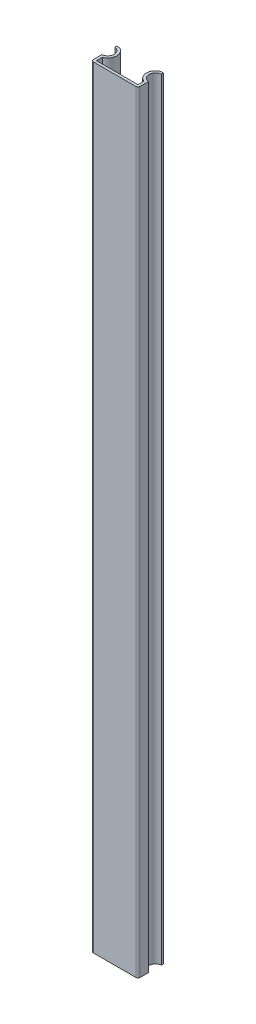
ISO-10303-21;
HEADER;
FILE_DESCRIPTION(('STEP AP214'),'2;1');
FILE_NAME('part.step','',(''),(''),'','','');
FILE_SCHEMA(('AUTOMOTIVE_DESIGN { 1 0 10303 214 1 1 1 1 }'));
ENDSEC;
DATA;
#1=APPLICATION_CONTEXT('core data for automotive mechanical design processes');
#2=APPLICATION_PROTOCOL_DEFINITION('international standard','automotive_design',2000,#1);
#3=PRODUCT_CONTEXT('',#1,'mechanical');
#4=PRODUCT('Part','Part','',(#3));
#5=PRODUCT_RELATED_PRODUCT_CATEGORY('part','',(#4));
#6=PRODUCT_DEFINITION_FORMATION('','',#4);
#7=PRODUCT_DEFINITION_CONTEXT('part definition',#1,'design');
#8=PRODUCT_DEFINITION('design','',#6,#7);
#9=PRODUCT_DEFINITION_SHAPE('','',#8);
#10=(LENGTH_UNIT() NAMED_UNIT(*) SI_UNIT(.MILLI.,.METRE.));
#11=(NAMED_UNIT(*) PLANE_ANGLE_UNIT() SI_UNIT($,.RADIAN.));
#12=(NAMED_UNIT(*) SI_UNIT($,.STERADIAN.) SOLID_ANGLE_UNIT());
#13=UNCERTAINTY_MEASURE_WITH_UNIT(LENGTH_MEASURE(1.E-05),#10,'distance_accuracy_value','');
#14=(GEOMETRIC_REPRESENTATION_CONTEXT(3) GLOBAL_UNCERTAINTY_ASSIGNED_CONTEXT((#13)) GLOBAL_UNIT_ASSIGNED_CONTEXT((#10,
#11,#12)) REPRESENTATION_CONTEXT('',''));
#15=CARTESIAN_POINT('',(0.,0.,0.));
#16=DIRECTION('',(0.,0.,1.));
#17=DIRECTION('',(1.,0.,0.));
#18=AXIS2_PLACEMENT_3D('',#15,#16,#17);
#19=CARTESIAN_POINT('',(-5.5,182.,0.));
#20=DIRECTION('',(1.,0.,0.));
#21=DIRECTION('',(0.,0.,-1.));
#22=AXIS2_PLACEMENT_3D('',#19,#20,#21);
#23=PLANE('',#22);
#24=DIRECTION('',(0.,0.,1.));
#25=VECTOR('',#24,1.);
#26=CARTESIAN_POINT('',(-5.5,0.,0.));
#27=LINE('',#26,#25);
#28=CARTESIAN_POINT('',(-5.5,0.,-2.47684537882722));
#29=VERTEX_POINT('',#28);
#30=CARTESIAN_POINT('',(-5.5,0.,-0.499999999999999));
#31=VERTEX_POINT('',#30);
#32=EDGE_CURVE('E191',#29,#31,#27,.T.);
#33=ORIENTED_EDGE('',*,*,#32,.T.);
#34=DIRECTION('',(0.,-1.,0.));
#35=VECTOR('',#34,1.);
#36=CARTESIAN_POINT('',(-5.5,182.,-0.499999999999999));
#37=LINE('',#36,#35);
#38=CARTESIAN_POINT('',(-5.5,182.,-0.499999999999999));
#39=VERTEX_POINT('',#38);
#40=EDGE_CURVE('E54',#31,#39,#37,.F.);
#41=ORIENTED_EDGE('',*,*,#40,.T.);
#42=DIRECTION('',(0.,0.,1.));
#43=VECTOR('',#42,1.);
#44=CARTESIAN_POINT('',(-5.5,182.,0.));
#45=LINE('',#44,#43);
#46=CARTESIAN_POINT('',(-5.5,182.,-2.47684537882722));
#47=VERTEX_POINT('',#46);
#48=EDGE_CURVE('E219',#47,#39,#45,.T.);
#49=ORIENTED_EDGE('',*,*,#48,.F.);
#50=DIRECTION('',(0.,-1.,0.));
#51=VECTOR('',#50,1.);
#52=CARTESIAN_POINT('',(-5.5,182.,-2.47684537882722));
#53=LINE('',#52,#51);
#54=EDGE_CURVE('E190',#47,#29,#53,.T.);
#55=ORIENTED_EDGE('',*,*,#54,.T.);
#56=EDGE_LOOP('',(#33,#41,#49,#55));
#57=FACE_BOUND('',#56,.T.);
#58=ADVANCED_FACE('F31',(#57),#23,.F.);
#59=CARTESIAN_POINT('',(5.5,182.,0.));
#60=DIRECTION('',(0.,0.,-1.));
#61=DIRECTION('',(-1.,0.,0.));
#62=AXIS2_PLACEMENT_3D('',#59,#60,#61);
#63=PLANE('',#62);
#64=DIRECTION('',(1.,0.,0.));
#65=VECTOR('',#64,1.);
#66=CARTESIAN_POINT('',(5.5,182.,0.));
#67=LINE('',#66,#65);
#68=CARTESIAN_POINT('',(-5.,182.,0.));
#69=VERTEX_POINT('',#68);
#70=CARTESIAN_POINT('',(5.,182.,0.));
#71=VERTEX_POINT('',#70);
#72=EDGE_CURVE('E152',#69,#71,#67,.T.);
#73=ORIENTED_EDGE('',*,*,#72,.F.);
#74=DIRECTION('',(0.,-1.,0.));
#75=VECTOR('',#74,1.);
#76=CARTESIAN_POINT('',(-5.,182.,0.));
#77=LINE('',#76,#75);
#78=CARTESIAN_POINT('',(-5.,0.,0.));
#79=VERTEX_POINT('',#78);
#80=EDGE_CURVE('E251',#69,#79,#77,.T.);
#81=ORIENTED_EDGE('',*,*,#80,.T.);
#82=DIRECTION('',(1.,0.,0.));
#83=VECTOR('',#82,1.);
#84=CARTESIAN_POINT('',(5.5,0.,0.));
#85=LINE('',#84,#83);
#86=CARTESIAN_POINT('',(5.,0.,0.));
#87=VERTEX_POINT('',#86);
#88=EDGE_CURVE('E193',#79,#87,#85,.T.);
#89=ORIENTED_EDGE('',*,*,#88,.T.);
#90=DIRECTION('',(0.,-1.,0.));
#91=VECTOR('',#90,1.);
#92=CARTESIAN_POINT('',(5.,182.,0.));
#93=LINE('',#92,#91);
#94=EDGE_CURVE('E161',#87,#71,#93,.F.);
#95=ORIENTED_EDGE('',*,*,#94,.T.);
#96=EDGE_LOOP('',(#73,#81,#89,#95));
#97=FACE_BOUND('',#96,.T.);
#98=ADVANCED_FACE('F264',(#97),#63,.F.);
#99=CARTESIAN_POINT('',(5.5,182.,0.));
#100=DIRECTION('',(-1.,0.,0.));
#101=DIRECTION('',(0.,0.,1.));
#102=AXIS2_PLACEMENT_3D('',#99,#100,#101);
#103=PLANE('',#102);
#104=DIRECTION('',(0.,0.,-1.));
#105=VECTOR('',#104,1.);
#106=CARTESIAN_POINT('',(5.5,182.,0.));
#107=LINE('',#106,#105);
#108=CARTESIAN_POINT('',(5.5,182.,-0.499999999999999));
#109=VERTEX_POINT('',#108);
#110=CARTESIAN_POINT('',(5.5,182.,-2.47684537882722));
#111=VERTEX_POINT('',#110);
#112=EDGE_CURVE('E144',#109,#111,#107,.T.);
#113=ORIENTED_EDGE('',*,*,#112,.F.);
#114=DIRECTION('',(0.,-1.,0.));
#115=VECTOR('',#114,1.);
#116=CARTESIAN_POINT('',(5.5,182.,-0.499999999999999));
#117=LINE('',#116,#115);
#118=CARTESIAN_POINT('',(5.5,0.,-0.499999999999999));
#119=VERTEX_POINT('',#118);
#120=EDGE_CURVE('E11',#109,#119,#117,.T.);
#121=ORIENTED_EDGE('',*,*,#120,.T.);
#122=DIRECTION('',(0.,0.,-1.));
#123=VECTOR('',#122,1.);
#124=CARTESIAN_POINT('',(5.5,0.,0.));
#125=LINE('',#124,#123);
#126=CARTESIAN_POINT('',(5.5,0.,-2.47684537882722));
#127=VERTEX_POINT('',#126);
#128=EDGE_CURVE('E158',#119,#127,#125,.T.);
#129=ORIENTED_EDGE('',*,*,#128,.T.);
#130=DIRECTION('',(0.,-1.,0.));
#131=VECTOR('',#130,1.);
#132=CARTESIAN_POINT('',(5.5,182.,-2.47684537882722));
#133=LINE('',#132,#131);
#134=EDGE_CURVE('E155',#111,#127,#133,.T.);
#135=ORIENTED_EDGE('',*,*,#134,.F.);
#136=EDGE_LOOP('',(#113,#121,#129,#135));
#137=FACE_BOUND('',#136,.T.);
#138=ADVANCED_FACE('F156',(#137),#103,.F.);
#139=CARTESIAN_POINT('',(5.62857142857143,182.,-4.));
#140=DIRECTION('',(0.,-1.,0.));
#141=DIRECTION('',(0.,0.,-1.));
#142=AXIS2_PLACEMENT_3D('',#139,#140,#141);
#143=CYLINDRICAL_SURFACE('',#142,1.52857142857143);
#144=CARTESIAN_POINT('',(5.62857142857143,0.,-4.));
#145=DIRECTION('',(0.,-1.,0.));
#146=DIRECTION('',(0.,0.,-1.));
#147=AXIS2_PLACEMENT_3D('',#144,#145,#146);
#148=CIRCLE('',#147,1.52857142857143);
#149=CARTESIAN_POINT('',(5.5,0.,-5.52315462117278));
#150=VERTEX_POINT('',#149);
#151=EDGE_CURVE('E197',#127,#150,#148,.T.);
#152=ORIENTED_EDGE('',*,*,#151,.T.);
#153=DIRECTION('',(0.,-1.,0.));
#154=VECTOR('',#153,1.);
#155=CARTESIAN_POINT('',(5.5,182.,-5.52315462117278));
#156=LINE('',#155,#154);
#157=CARTESIAN_POINT('',(5.5,182.,-5.52315462117278));
#158=VERTEX_POINT('',#157);
#159=EDGE_CURVE('E162',#158,#150,#156,.T.);
#160=ORIENTED_EDGE('',*,*,#159,.F.);
#161=CARTESIAN_POINT('',(5.62857142857143,182.,-4.));
#162=DIRECTION('',(0.,-1.,0.));
#163=DIRECTION('',(0.,0.,-1.));
#164=AXIS2_PLACEMENT_3D('',#161,#162,#163);
#165=CIRCLE('',#164,1.52857142857143);
#166=EDGE_CURVE('E148',#111,#158,#165,.T.);
#167=ORIENTED_EDGE('',*,*,#166,.F.);
#168=ORIENTED_EDGE('',*,*,#134,.T.);
#169=EDGE_LOOP('',(#152,#160,#167,#168));
#170=FACE_BOUND('',#169,.T.);
#171=ADVANCED_FACE('F164',(#170),#143,.F.);
#172=CARTESIAN_POINT('',(5.5,182.,-6.));
#173=DIRECTION('',(-1.,0.,0.));
#174=DIRECTION('',(0.,0.,1.));
#175=AXIS2_PLACEMENT_3D('',#172,#173,#174);
#176=PLANE('',#175);
#177=DIRECTION('',(0.,0.,-1.));
#178=VECTOR('',#177,1.);
#179=CARTESIAN_POINT('',(5.5,0.,-6.));
#180=LINE('',#179,#178);
#181=CARTESIAN_POINT('',(5.5,0.,-6.));
#182=VERTEX_POINT('',#181);
#183=EDGE_CURVE('E199',#150,#182,#180,.T.);
#184=ORIENTED_EDGE('',*,*,#183,.T.);
#185=DIRECTION('',(0.,-1.,0.));
#186=VECTOR('',#185,1.);
#187=CARTESIAN_POINT('',(5.5,182.,-6.));
#188=LINE('',#187,#186);
#189=CARTESIAN_POINT('',(5.5,182.,-6.));
#190=VERTEX_POINT('',#189);
#191=EDGE_CURVE('E246',#190,#182,#188,.T.);
#192=ORIENTED_EDGE('',*,*,#191,.F.);
#193=DIRECTION('',(0.,0.,-1.));
#194=VECTOR('',#193,1.);
#195=CARTESIAN_POINT('',(5.5,182.,-6.));
#196=LINE('',#195,#194);
#197=EDGE_CURVE('E167',#158,#190,#196,.T.);
#198=ORIENTED_EDGE('',*,*,#197,.F.);
#199=ORIENTED_EDGE('',*,*,#159,.T.);
#200=EDGE_LOOP('',(#184,#192,#198,#199));
#201=FACE_BOUND('',#200,.T.);
#202=ADVANCED_FACE('F319',(#201),#176,.F.);
#203=CARTESIAN_POINT('',(5.5,182.,-6.));
#204=DIRECTION('',(0.,0.,1.));
#205=DIRECTION('',(1.,0.,0.));
#206=AXIS2_PLACEMENT_3D('',#203,#204,#205);
#207=PLANE('',#206);
#208=DIRECTION('',(-1.,0.,0.));
#209=VECTOR('',#208,1.);
#210=CARTESIAN_POINT('',(5.5,0.,-6.));
#211=LINE('',#210,#209);
#212=CARTESIAN_POINT('',(4.9,0.,-6.));
#213=VERTEX_POINT('',#212);
#214=EDGE_CURVE('E201',#182,#213,#211,.T.);
#215=ORIENTED_EDGE('',*,*,#214,.T.);
#216=DIRECTION('',(0.,-1.,0.));
#217=VECTOR('',#216,1.);
#218=CARTESIAN_POINT('',(4.9,182.,-6.));
#219=LINE('',#218,#217);
#220=CARTESIAN_POINT('',(4.9,182.,-6.));
#221=VERTEX_POINT('',#220);
#222=EDGE_CURVE('E243',#221,#213,#219,.T.);
#223=ORIENTED_EDGE('',*,*,#222,.F.);
#224=DIRECTION('',(-1.,0.,0.));
#225=VECTOR('',#224,1.);
#226=CARTESIAN_POINT('',(5.5,182.,-6.));
#227=LINE('',#226,#225);
#228=EDGE_CURVE('E169',#190,#221,#227,.T.);
#229=ORIENTED_EDGE('',*,*,#228,.F.);
#230=ORIENTED_EDGE('',*,*,#191,.T.);
#231=EDGE_LOOP('',(#215,#223,#229,#230));
#232=FACE_BOUND('',#231,.T.);
#233=ADVANCED_FACE('F316',(#232),#207,.F.);
#234=CARTESIAN_POINT('',(5.62857142857143,182.,-4.));
#235=DIRECTION('',(0.,-1.,0.));
#236=DIRECTION('',(0.,0.,-1.));
#237=AXIS2_PLACEMENT_3D('',#234,#235,#236);
#238=CYLINDRICAL_SURFACE('',#237,2.12857142857143);
#239=CARTESIAN_POINT('',(5.62857142857143,0.,-4.));
#240=DIRECTION('',(0.,1.,0.));
#241=DIRECTION('',(0.,0.,-1.));
#242=AXIS2_PLACEMENT_3D('',#239,#240,#241);
#243=CIRCLE('',#242,2.12857142857143);
#244=CARTESIAN_POINT('',(4.9,0.,-2.));
#245=VERTEX_POINT('',#244);
#246=EDGE_CURVE('E203',#213,#245,#243,.T.);
#247=ORIENTED_EDGE('',*,*,#246,.T.);
#248=DIRECTION('',(0.,-1.,0.));
#249=VECTOR('',#248,1.);
#250=CARTESIAN_POINT('',(4.9,182.,-2.));
#251=LINE('',#250,#249);
#252=CARTESIAN_POINT('',(4.9,182.,-2.));
#253=VERTEX_POINT('',#252);
#254=EDGE_CURVE('E240',#253,#245,#251,.T.);
#255=ORIENTED_EDGE('',*,*,#254,.F.);
#256=CARTESIAN_POINT('',(5.62857142857143,182.,-4.));
#257=DIRECTION('',(0.,1.,0.));
#258=DIRECTION('',(0.,0.,-1.));
#259=AXIS2_PLACEMENT_3D('',#256,#257,#258);
#260=CIRCLE('',#259,2.12857142857143);
#261=EDGE_CURVE('E174',#221,#253,#260,.T.);
#262=ORIENTED_EDGE('',*,*,#261,.F.);
#263=ORIENTED_EDGE('',*,*,#222,.T.);
#264=EDGE_LOOP('',(#247,#255,#262,#263));
#265=FACE_BOUND('',#264,.T.);
#266=ADVANCED_FACE('F311',(#265),#238,.T.);
#267=CARTESIAN_POINT('',(4.9,182.,-0.599999999999999));
#268=DIRECTION('',(1.,0.,0.));
#269=DIRECTION('',(0.,0.,-1.));
#270=AXIS2_PLACEMENT_3D('',#267,#268,#269);
#271=PLANE('',#270);
#272=DIRECTION('',(0.,0.,1.));
#273=VECTOR('',#272,1.);
#274=CARTESIAN_POINT('',(4.9,0.,-0.599999999999999));
#275=LINE('',#274,#273);
#276=CARTESIAN_POINT('',(4.9,0.,-0.599999999999999));
#277=VERTEX_POINT('',#276);
#278=EDGE_CURVE('E205',#245,#277,#275,.T.);
#279=ORIENTED_EDGE('',*,*,#278,.T.);
#280=DIRECTION('',(0.,-1.,0.));
#281=VECTOR('',#280,1.);
#282=CARTESIAN_POINT('',(4.9,182.,-0.599999999999999));
#283=LINE('',#282,#281);
#284=CARTESIAN_POINT('',(4.9,182.,-0.599999999999999));
#285=VERTEX_POINT('',#284);
#286=EDGE_CURVE('E237',#285,#277,#283,.T.);
#287=ORIENTED_EDGE('',*,*,#286,.F.);
#288=DIRECTION('',(0.,0.,1.));
#289=VECTOR('',#288,1.);
#290=CARTESIAN_POINT('',(4.9,182.,-0.599999999999999));
#291=LINE('',#290,#289);
#292=EDGE_CURVE('E176',#253,#285,#291,.T.);
#293=ORIENTED_EDGE('',*,*,#292,.F.);
#294=ORIENTED_EDGE('',*,*,#254,.T.);
#295=EDGE_LOOP('',(#279,#287,#293,#294));
#296=FACE_BOUND('',#295,.T.);
#297=ADVANCED_FACE('F305',(#296),#271,.F.);
#298=CARTESIAN_POINT('',(4.9,182.,-0.599999999999999));
#299=DIRECTION('',(0.,0.,1.));
#300=DIRECTION('',(1.,0.,0.));
#301=AXIS2_PLACEMENT_3D('',#298,#299,#300);
#302=PLANE('',#301);
#303=DIRECTION('',(-1.,0.,0.));
#304=VECTOR('',#303,1.);
#305=CARTESIAN_POINT('',(4.9,0.,-0.599999999999999));
#306=LINE('',#305,#304);
#307=CARTESIAN_POINT('',(-4.9,0.,-0.599999999999999));
#308=VERTEX_POINT('',#307);
#309=EDGE_CURVE('E207',#277,#308,#306,.T.);
#310=ORIENTED_EDGE('',*,*,#309,.T.);
#311=DIRECTION('',(0.,-1.,0.));
#312=VECTOR('',#311,1.);
#313=CARTESIAN_POINT('',(-4.9,182.,-0.599999999999999));
#314=LINE('',#313,#312);
#315=CARTESIAN_POINT('',(-4.9,182.,-0.599999999999999));
#316=VERTEX_POINT('',#315);
#317=EDGE_CURVE('E234',#316,#308,#314,.T.);
#318=ORIENTED_EDGE('',*,*,#317,.F.);
#319=DIRECTION('',(-1.,0.,0.));
#320=VECTOR('',#319,1.);
#321=CARTESIAN_POINT('',(4.9,182.,-0.599999999999999));
#322=LINE('',#321,#320);
#323=EDGE_CURVE('E178',#285,#316,#322,.T.);
#324=ORIENTED_EDGE('',*,*,#323,.F.);
#325=ORIENTED_EDGE('',*,*,#286,.T.);
#326=EDGE_LOOP('',(#310,#318,#324,#325));
#327=FACE_BOUND('',#326,.T.);
#328=ADVANCED_FACE('F301',(#327),#302,.F.);
#329=CARTESIAN_POINT('',(-4.9,182.,-0.599999999999999));
#330=DIRECTION('',(-1.,0.,0.));
#331=DIRECTION('',(0.,0.,1.));
#332=AXIS2_PLACEMENT_3D('',#329,#330,#331);
#333=PLANE('',#332);
#334=DIRECTION('',(0.,0.,-1.));
#335=VECTOR('',#334,1.);
#336=CARTESIAN_POINT('',(-4.9,0.,-0.599999999999999));
#337=LINE('',#336,#335);
#338=CARTESIAN_POINT('',(-4.9,0.,-2.));
#339=VERTEX_POINT('',#338);
#340=EDGE_CURVE('E209',#308,#339,#337,.T.);
#341=ORIENTED_EDGE('',*,*,#340,.T.);
#342=DIRECTION('',(0.,-1.,0.));
#343=VECTOR('',#342,1.);
#344=CARTESIAN_POINT('',(-4.9,182.,-2.));
#345=LINE('',#344,#343);
#346=CARTESIAN_POINT('',(-4.9,182.,-2.));
#347=VERTEX_POINT('',#346);
#348=EDGE_CURVE('E231',#347,#339,#345,.T.);
#349=ORIENTED_EDGE('',*,*,#348,.F.);
#350=DIRECTION('',(0.,0.,-1.));
#351=VECTOR('',#350,1.);
#352=CARTESIAN_POINT('',(-4.9,182.,-0.599999999999999));
#353=LINE('',#352,#351);
#354=EDGE_CURVE('E180',#316,#347,#353,.T.);
#355=ORIENTED_EDGE('',*,*,#354,.F.);
#356=ORIENTED_EDGE('',*,*,#317,.T.);
#357=EDGE_LOOP('',(#341,#349,#355,#356));
#358=FACE_BOUND('',#357,.T.);
#359=ADVANCED_FACE('F296',(#358),#333,.F.);
#360=CARTESIAN_POINT('',(-5.62857142857143,182.,-4.));
#361=DIRECTION('',(0.,-1.,0.));
#362=DIRECTION('',(0.,0.,-1.));
#363=AXIS2_PLACEMENT_3D('',#360,#361,#362);
#364=CYLINDRICAL_SURFACE('',#363,2.12857142857143);
#365=CARTESIAN_POINT('',(-5.62857142857143,0.,-4.));
#366=DIRECTION('',(0.,1.,0.));
#367=DIRECTION('',(0.,0.,1.));
#368=AXIS2_PLACEMENT_3D('',#365,#366,#367);
#369=CIRCLE('',#368,2.12857142857143);
#370=CARTESIAN_POINT('',(-4.9,0.,-6.));
#371=VERTEX_POINT('',#370);
#372=EDGE_CURVE('E211',#339,#371,#369,.T.);
#373=ORIENTED_EDGE('',*,*,#372,.T.);
#374=DIRECTION('',(0.,-1.,0.));
#375=VECTOR('',#374,1.);
#376=CARTESIAN_POINT('',(-4.9,182.,-6.));
#377=LINE('',#376,#375);
#378=CARTESIAN_POINT('',(-4.9,182.,-6.));
#379=VERTEX_POINT('',#378);
#380=EDGE_CURVE('E228',#379,#371,#377,.T.);
#381=ORIENTED_EDGE('',*,*,#380,.F.);
#382=CARTESIAN_POINT('',(-5.62857142857143,182.,-4.));
#383=DIRECTION('',(0.,1.,0.));
#384=DIRECTION('',(0.,0.,1.));
#385=AXIS2_PLACEMENT_3D('',#382,#383,#384);
#386=CIRCLE('',#385,2.12857142857143);
#387=EDGE_CURVE('E182',#347,#379,#386,.T.);
#388=ORIENTED_EDGE('',*,*,#387,.F.);
#389=ORIENTED_EDGE('',*,*,#348,.T.);
#390=EDGE_LOOP('',(#373,#381,#388,#389));
#391=FACE_BOUND('',#390,.T.);
#392=ADVANCED_FACE('F290',(#391),#364,.T.);
#393=CARTESIAN_POINT('',(-5.5,182.,-6.));
#394=DIRECTION('',(0.,0.,1.));
#395=DIRECTION('',(1.,0.,0.));
#396=AXIS2_PLACEMENT_3D('',#393,#394,#395);
#397=PLANE('',#396);
#398=DIRECTION('',(-1.,0.,0.));
#399=VECTOR('',#398,1.);
#400=CARTESIAN_POINT('',(-5.5,0.,-6.));
#401=LINE('',#400,#399);
#402=CARTESIAN_POINT('',(-5.5,0.,-6.));
#403=VERTEX_POINT('',#402);
#404=EDGE_CURVE('E213',#371,#403,#401,.T.);
#405=ORIENTED_EDGE('',*,*,#404,.T.);
#406=DIRECTION('',(0.,-1.,0.));
#407=VECTOR('',#406,1.);
#408=CARTESIAN_POINT('',(-5.5,182.,-6.));
#409=LINE('',#408,#407);
#410=CARTESIAN_POINT('',(-5.5,182.,-6.));
#411=VERTEX_POINT('',#410);
#412=EDGE_CURVE('E225',#411,#403,#409,.T.);
#413=ORIENTED_EDGE('',*,*,#412,.F.);
#414=DIRECTION('',(-1.,0.,0.));
#415=VECTOR('',#414,1.);
#416=CARTESIAN_POINT('',(-5.5,182.,-6.));
#417=LINE('',#416,#415);
#418=EDGE_CURVE('E184',#379,#411,#417,.T.);
#419=ORIENTED_EDGE('',*,*,#418,.F.);
#420=ORIENTED_EDGE('',*,*,#380,.T.);
#421=EDGE_LOOP('',(#405,#413,#419,#420));
#422=FACE_BOUND('',#421,.T.);
#423=ADVANCED_FACE('F286',(#422),#397,.F.);
#424=CARTESIAN_POINT('',(-5.5,182.,-6.));
#425=DIRECTION('',(1.,0.,0.));
#426=DIRECTION('',(0.,0.,-1.));
#427=AXIS2_PLACEMENT_3D('',#424,#425,#426);
#428=PLANE('',#427);
#429=DIRECTION('',(0.,0.,1.));
#430=VECTOR('',#429,1.);
#431=CARTESIAN_POINT('',(-5.5,0.,-6.));
#432=LINE('',#431,#430);
#433=CARTESIAN_POINT('',(-5.5,0.,-5.52315462117278));
#434=VERTEX_POINT('',#433);
#435=EDGE_CURVE('E215',#403,#434,#432,.T.);
#436=ORIENTED_EDGE('',*,*,#435,.T.);
#437=DIRECTION('',(0.,-1.,0.));
#438=VECTOR('',#437,1.);
#439=CARTESIAN_POINT('',(-5.5,182.,-5.52315462117278));
#440=LINE('',#439,#438);
#441=CARTESIAN_POINT('',(-5.5,182.,-5.52315462117278));
#442=VERTEX_POINT('',#441);
#443=EDGE_CURVE('E222',#442,#434,#440,.T.);
#444=ORIENTED_EDGE('',*,*,#443,.F.);
#445=DIRECTION('',(0.,0.,1.));
#446=VECTOR('',#445,1.);
#447=CARTESIAN_POINT('',(-5.5,182.,-6.));
#448=LINE('',#447,#446);
#449=EDGE_CURVE('E186',#411,#442,#448,.T.);
#450=ORIENTED_EDGE('',*,*,#449,.F.);
#451=ORIENTED_EDGE('',*,*,#412,.T.);
#452=EDGE_LOOP('',(#436,#444,#450,#451));
#453=FACE_BOUND('',#452,.T.);
#454=ADVANCED_FACE('F281',(#453),#428,.F.);
#455=CARTESIAN_POINT('',(-5.62857142857143,182.,-4.));
#456=DIRECTION('',(0.,-1.,0.));
#457=DIRECTION('',(0.,0.,-1.));
#458=AXIS2_PLACEMENT_3D('',#455,#456,#457);
#459=CYLINDRICAL_SURFACE('',#458,1.52857142857143);
#460=CARTESIAN_POINT('',(-5.62857142857143,0.,-4.));
#461=DIRECTION('',(0.,-1.,0.));
#462=DIRECTION('',(0.,0.,1.));
#463=AXIS2_PLACEMENT_3D('',#460,#461,#462);
#464=CIRCLE('',#463,1.52857142857143);
#465=EDGE_CURVE('E217',#434,#29,#464,.T.);
#466=ORIENTED_EDGE('',*,*,#465,.T.);
#467=ORIENTED_EDGE('',*,*,#54,.F.);
#468=CARTESIAN_POINT('',(-5.62857142857143,182.,-4.));
#469=DIRECTION('',(0.,-1.,0.));
#470=DIRECTION('',(0.,0.,1.));
#471=AXIS2_PLACEMENT_3D('',#468,#469,#470);
#472=CIRCLE('',#471,1.52857142857143);
#473=EDGE_CURVE('E188',#442,#47,#472,.T.);
#474=ORIENTED_EDGE('',*,*,#473,.F.);
#475=ORIENTED_EDGE('',*,*,#443,.T.);
#476=EDGE_LOOP('',(#466,#467,#474,#475));
#477=FACE_BOUND('',#476,.T.);
#478=ADVANCED_FACE('F275',(#477),#459,.F.);
#479=CARTESIAN_POINT('',(-5.62857142857143,182.,-4.));
#480=DIRECTION('',(0.,1.,0.));
#481=DIRECTION('',(0.,0.,1.));
#482=AXIS2_PLACEMENT_3D('',#479,#480,#481);
#483=PLANE('',#482);
#484=ORIENTED_EDGE('',*,*,#48,.T.);
#485=CARTESIAN_POINT('',(-5.,182.,-0.499999999999998));
#486=DIRECTION('',(0.,1.,0.));
#487=DIRECTION('',(0.,0.,1.));
#488=AXIS2_PLACEMENT_3D('',#485,#486,#487);
#489=CIRCLE('',#488,0.5);
#490=EDGE_CURVE('E39',#39,#69,#489,.T.);
#491=ORIENTED_EDGE('',*,*,#490,.T.);
#492=ORIENTED_EDGE('',*,*,#72,.T.);
#493=CARTESIAN_POINT('',(5.,182.,-0.499999999999998));
#494=DIRECTION('',(0.,1.,0.));
#495=DIRECTION('',(0.,0.,1.));
#496=AXIS2_PLACEMENT_3D('',#493,#494,#495);
#497=CIRCLE('',#496,0.5);
#498=EDGE_CURVE('E46',#71,#109,#497,.T.);
#499=ORIENTED_EDGE('',*,*,#498,.T.);
#500=ORIENTED_EDGE('',*,*,#112,.T.);
#501=ORIENTED_EDGE('',*,*,#166,.T.);
#502=ORIENTED_EDGE('',*,*,#197,.T.);
#503=ORIENTED_EDGE('',*,*,#228,.T.);
#504=ORIENTED_EDGE('',*,*,#261,.T.);
#505=ORIENTED_EDGE('',*,*,#292,.T.);
#506=ORIENTED_EDGE('',*,*,#323,.T.);
#507=ORIENTED_EDGE('',*,*,#354,.T.);
#508=ORIENTED_EDGE('',*,*,#387,.T.);
#509=ORIENTED_EDGE('',*,*,#418,.T.);
#510=ORIENTED_EDGE('',*,*,#449,.T.);
#511=ORIENTED_EDGE('',*,*,#473,.T.);
#512=EDGE_LOOP('',(#484,#491,#492,#499,#500,#501,#502,#503,#504,#505,#506,#507,#508,#509,#510,#511));
#513=FACE_BOUND('',#512,.T.);
#514=ADVANCED_FACE('F146',(#513),#483,.T.);
#515=CARTESIAN_POINT('',(-5.62857142857143,0.,-4.));
#516=DIRECTION('',(0.,1.,0.));
#517=DIRECTION('',(0.,0.,1.));
#518=AXIS2_PLACEMENT_3D('',#515,#516,#517);
#519=PLANE('',#518);
#520=ORIENTED_EDGE('',*,*,#88,.F.);
#521=CARTESIAN_POINT('',(-5.,0.,-0.499999999999998));
#522=DIRECTION('',(0.,1.,0.));
#523=DIRECTION('',(0.,0.,1.));
#524=AXIS2_PLACEMENT_3D('',#521,#522,#523);
#525=CIRCLE('',#524,0.5);
#526=EDGE_CURVE('E256',#79,#31,#525,.F.);
#527=ORIENTED_EDGE('',*,*,#526,.T.);
#528=ORIENTED_EDGE('',*,*,#32,.F.);
#529=ORIENTED_EDGE('',*,*,#465,.F.);
#530=ORIENTED_EDGE('',*,*,#435,.F.);
#531=ORIENTED_EDGE('',*,*,#404,.F.);
#532=ORIENTED_EDGE('',*,*,#372,.F.);
#533=ORIENTED_EDGE('',*,*,#340,.F.);
#534=ORIENTED_EDGE('',*,*,#309,.F.);
#535=ORIENTED_EDGE('',*,*,#278,.F.);
#536=ORIENTED_EDGE('',*,*,#246,.F.);
#537=ORIENTED_EDGE('',*,*,#214,.F.);
#538=ORIENTED_EDGE('',*,*,#183,.F.);
#539=ORIENTED_EDGE('',*,*,#151,.F.);
#540=ORIENTED_EDGE('',*,*,#128,.F.);
#541=CARTESIAN_POINT('',(5.,0.,-0.499999999999998));
#542=DIRECTION('',(0.,1.,0.));
#543=DIRECTION('',(0.,0.,1.));
#544=AXIS2_PLACEMENT_3D('',#541,#542,#543);
#545=CIRCLE('',#544,0.5);
#546=EDGE_CURVE('E254',#119,#87,#545,.F.);
#547=ORIENTED_EDGE('',*,*,#546,.T.);
#548=EDGE_LOOP('',(#520,#527,#528,#529,#530,#531,#532,#533,#534,#535,#536,#537,#538,#539,#540,#547));
#549=FACE_BOUND('',#548,.T.);
#550=ADVANCED_FACE('F270',(#549),#519,.F.);
#551=CARTESIAN_POINT('',(-5.,182.,-0.499999999999998));
#552=DIRECTION('',(0.,-1.,0.));
#553=DIRECTION('',(0.,0.,-1.));
#554=AXIS2_PLACEMENT_3D('',#551,#552,#553);
#555=CYLINDRICAL_SURFACE('',#554,0.5);
#556=ORIENTED_EDGE('',*,*,#490,.F.);
#557=ORIENTED_EDGE('',*,*,#40,.F.);
#558=ORIENTED_EDGE('',*,*,#526,.F.);
#559=ORIENTED_EDGE('',*,*,#80,.F.);
#560=EDGE_LOOP('',(#556,#557,#558,#559));
#561=FACE_BOUND('',#560,.T.);
#562=ADVANCED_FACE('F267',(#561),#555,.T.);
#563=CARTESIAN_POINT('',(5.,182.,-0.499999999999998));
#564=DIRECTION('',(0.,-1.,0.));
#565=DIRECTION('',(0.,0.,-1.));
#566=AXIS2_PLACEMENT_3D('',#563,#564,#565);
#567=CYLINDRICAL_SURFACE('',#566,0.5);
#568=ORIENTED_EDGE('',*,*,#498,.F.);
#569=ORIENTED_EDGE('',*,*,#94,.F.);
#570=ORIENTED_EDGE('',*,*,#546,.F.);
#571=ORIENTED_EDGE('',*,*,#120,.F.);
#572=EDGE_LOOP('',(#568,#569,#570,#571));
#573=FACE_BOUND('',#572,.T.);
#574=ADVANCED_FACE('F33',(#573),#567,.T.);
#575=CLOSED_SHELL('',(#58,#98,#138,#171,#202,#233,#266,#297,#328,#359,#392,#423,#454,#478,#514,
#550,#562,#574));
#576=MANIFOLD_SOLID_BREP('B2',#575);
#577=ADVANCED_BREP_SHAPE_REPRESENTATION('',(#18,#576),#14);
#578=SHAPE_DEFINITION_REPRESENTATION(#9,#577);
ENDSEC;
END-ISO-10303-21;
